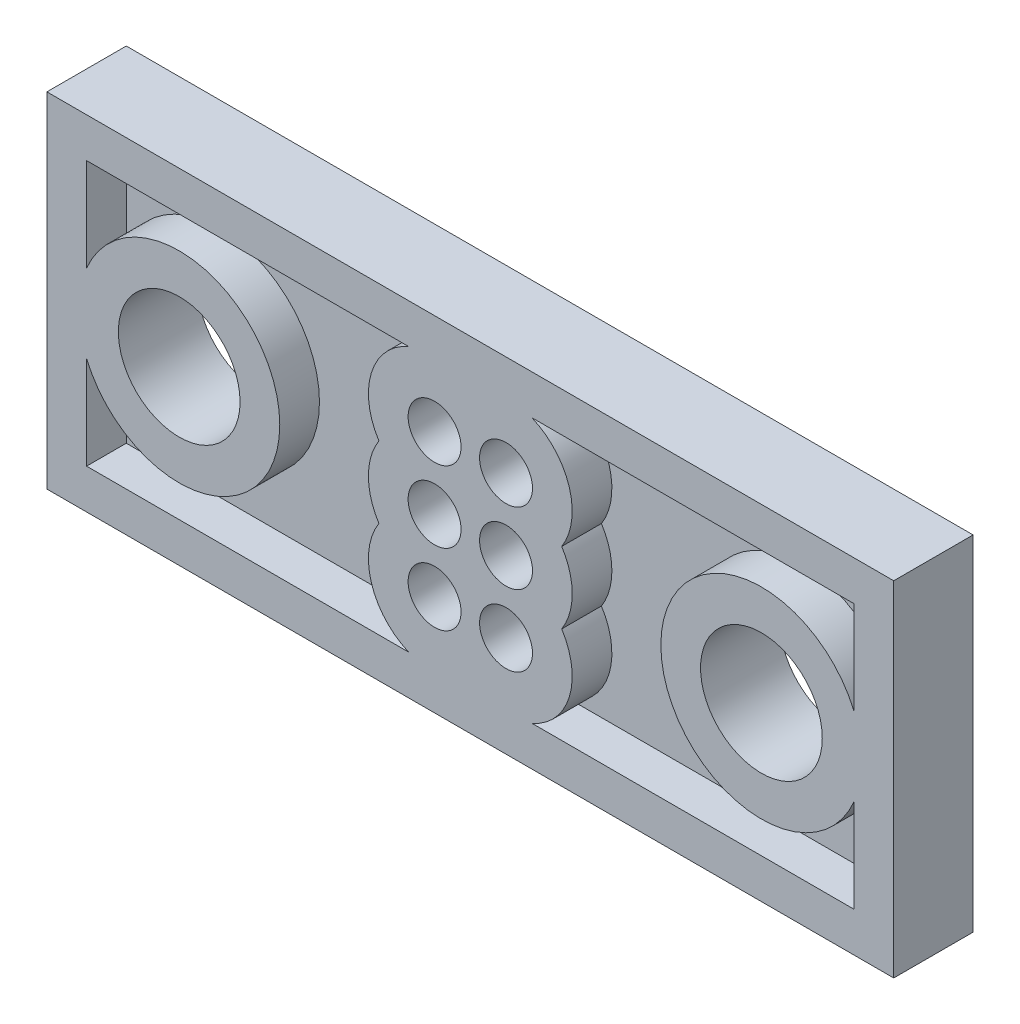
ISO-10303-21;
HEADER;
FILE_DESCRIPTION(('STEP AP214'),'2;1');
FILE_NAME('part.step','',(''),(''),'','','');
FILE_SCHEMA(('AUTOMOTIVE_DESIGN { 1 0 10303 214 1 1 1 1 }'));
ENDSEC;
DATA;
#1=APPLICATION_CONTEXT('core data for automotive mechanical design processes');
#2=APPLICATION_PROTOCOL_DEFINITION('international standard','automotive_design',2000,#1);
#3=PRODUCT_CONTEXT('',#1,'mechanical');
#4=PRODUCT('Part','Part','',(#3));
#5=PRODUCT_RELATED_PRODUCT_CATEGORY('part','',(#4));
#6=PRODUCT_DEFINITION_FORMATION('','',#4);
#7=PRODUCT_DEFINITION_CONTEXT('part definition',#1,'design');
#8=PRODUCT_DEFINITION('design','',#6,#7);
#9=PRODUCT_DEFINITION_SHAPE('','',#8);
#10=(LENGTH_UNIT() NAMED_UNIT(*) SI_UNIT(.MILLI.,.METRE.));
#11=(NAMED_UNIT(*) PLANE_ANGLE_UNIT() SI_UNIT($,.RADIAN.));
#12=(NAMED_UNIT(*) SI_UNIT($,.STERADIAN.) SOLID_ANGLE_UNIT());
#13=UNCERTAINTY_MEASURE_WITH_UNIT(LENGTH_MEASURE(1.E-05),#10,'distance_accuracy_value','');
#14=(GEOMETRIC_REPRESENTATION_CONTEXT(3) GLOBAL_UNCERTAINTY_ASSIGNED_CONTEXT((#13)) GLOBAL_UNIT_ASSIGNED_CONTEXT((#10,
#11,#12)) REPRESENTATION_CONTEXT('',''));
#15=CARTESIAN_POINT('',(0.,0.,0.));
#16=DIRECTION('',(0.,0.,1.));
#17=DIRECTION('',(1.,0.,0.));
#18=AXIS2_PLACEMENT_3D('',#15,#16,#17);
#19=CARTESIAN_POINT('',(0.,0.,3.));
#20=DIRECTION('',(0.,0.,-1.));
#21=DIRECTION('',(-1.,0.,0.));
#22=AXIS2_PLACEMENT_3D('',#19,#20,#21);
#23=PLANE('',#22);
#24=DIRECTION('',(0.,-1.,0.));
#25=VECTOR('',#24,1.);
#26=CARTESIAN_POINT('',(0.,0.,3.));
#27=LINE('',#26,#25);
#28=CARTESIAN_POINT('',(0.,13.,3.));
#29=VERTEX_POINT('',#28);
#30=CARTESIAN_POINT('',(0.,0.,3.));
#31=VERTEX_POINT('',#30);
#32=EDGE_CURVE('E350',#29,#31,#27,.T.);
#33=ORIENTED_EDGE('',*,*,#32,.T.);
#34=DIRECTION('',(1.,0.,0.));
#35=VECTOR('',#34,1.);
#36=CARTESIAN_POINT('',(0.,0.,3.));
#37=LINE('',#36,#35);
#38=CARTESIAN_POINT('',(32.,0.,3.));
#39=VERTEX_POINT('',#38);
#40=EDGE_CURVE('E353',#31,#39,#37,.T.);
#41=ORIENTED_EDGE('',*,*,#40,.T.);
#42=DIRECTION('',(0.,1.,0.));
#43=VECTOR('',#42,1.);
#44=CARTESIAN_POINT('',(32.,0.,3.));
#45=LINE('',#44,#43);
#46=CARTESIAN_POINT('',(32.,13.,3.));
#47=VERTEX_POINT('',#46);
#48=EDGE_CURVE('E356',#39,#47,#45,.T.);
#49=ORIENTED_EDGE('',*,*,#48,.T.);
#50=DIRECTION('',(-1.,0.,0.));
#51=VECTOR('',#50,1.);
#52=CARTESIAN_POINT('',(0.,13.,3.));
#53=LINE('',#52,#51);
#54=EDGE_CURVE('E358',#47,#29,#53,.T.);
#55=ORIENTED_EDGE('',*,*,#54,.T.);
#56=EDGE_LOOP('',(#33,#41,#49,#55));
#57=FACE_BOUND('',#56,.T.);
#58=CARTESIAN_POINT('',(5.,6.5,3.));
#59=DIRECTION('',(0.,0.,1.));
#60=DIRECTION('',(1.,0.,0.));
#61=AXIS2_PLACEMENT_3D('',#58,#59,#60);
#62=CIRCLE('',#61,2.3);
#63=CARTESIAN_POINT('',(7.3,6.5,3.));
#64=VERTEX_POINT('',#63);
#65=EDGE_CURVE('E344',#64,#64,#62,.T.);
#66=ORIENTED_EDGE('',*,*,#65,.F.);
#67=EDGE_LOOP('',(#66));
#68=FACE_BOUND('',#67,.T.);
#69=CARTESIAN_POINT('',(27.,6.5,3.));
#70=DIRECTION('',(0.,0.,1.));
#71=DIRECTION('',(1.,0.,0.));
#72=AXIS2_PLACEMENT_3D('',#69,#70,#71);
#73=CIRCLE('',#72,2.3);
#74=CARTESIAN_POINT('',(29.3,6.5,3.));
#75=VERTEX_POINT('',#74);
#76=EDGE_CURVE('E338',#75,#75,#73,.T.);
#77=ORIENTED_EDGE('',*,*,#76,.F.);
#78=EDGE_LOOP('',(#77));
#79=FACE_BOUND('',#78,.T.);
#80=CARTESIAN_POINT('',(14.65,9.2,3.));
#81=DIRECTION('',(0.,0.,1.));
#82=DIRECTION('',(1.,0.,0.));
#83=AXIS2_PLACEMENT_3D('',#80,#81,#82);
#84=CIRCLE('',#83,1.);
#85=CARTESIAN_POINT('',(15.65,9.2,3.));
#86=VERTEX_POINT('',#85);
#87=EDGE_CURVE('E332',#86,#86,#84,.T.);
#88=ORIENTED_EDGE('',*,*,#87,.F.);
#89=EDGE_LOOP('',(#88));
#90=FACE_BOUND('',#89,.T.);
#91=CARTESIAN_POINT('',(17.35,9.2,3.));
#92=DIRECTION('',(0.,0.,1.));
#93=DIRECTION('',(1.,0.,0.));
#94=AXIS2_PLACEMENT_3D('',#91,#92,#93);
#95=CIRCLE('',#94,1.);
#96=CARTESIAN_POINT('',(18.35,9.2,3.));
#97=VERTEX_POINT('',#96);
#98=EDGE_CURVE('E326',#97,#97,#95,.T.);
#99=ORIENTED_EDGE('',*,*,#98,.F.);
#100=EDGE_LOOP('',(#99));
#101=FACE_BOUND('',#100,.T.);
#102=CARTESIAN_POINT('',(17.35,6.5,3.));
#103=DIRECTION('',(0.,0.,1.));
#104=DIRECTION('',(1.,0.,0.));
#105=AXIS2_PLACEMENT_3D('',#102,#103,#104);
#106=CIRCLE('',#105,1.);
#107=CARTESIAN_POINT('',(18.35,6.5,3.));
#108=VERTEX_POINT('',#107);
#109=EDGE_CURVE('E320',#108,#108,#106,.T.);
#110=ORIENTED_EDGE('',*,*,#109,.F.);
#111=EDGE_LOOP('',(#110));
#112=FACE_BOUND('',#111,.T.);
#113=CARTESIAN_POINT('',(17.35,3.8,3.));
#114=DIRECTION('',(0.,0.,1.));
#115=DIRECTION('',(1.,0.,0.));
#116=AXIS2_PLACEMENT_3D('',#113,#114,#115);
#117=CIRCLE('',#116,1.);
#118=CARTESIAN_POINT('',(18.35,3.8,3.));
#119=VERTEX_POINT('',#118);
#120=EDGE_CURVE('E314',#119,#119,#117,.T.);
#121=ORIENTED_EDGE('',*,*,#120,.F.);
#122=EDGE_LOOP('',(#121));
#123=FACE_BOUND('',#122,.T.);
#124=CARTESIAN_POINT('',(14.65,3.8,3.));
#125=DIRECTION('',(0.,0.,1.));
#126=DIRECTION('',(1.,0.,0.));
#127=AXIS2_PLACEMENT_3D('',#124,#125,#126);
#128=CIRCLE('',#127,1.);
#129=CARTESIAN_POINT('',(15.65,3.8,3.));
#130=VERTEX_POINT('',#129);
#131=EDGE_CURVE('E308',#130,#130,#128,.T.);
#132=ORIENTED_EDGE('',*,*,#131,.F.);
#133=EDGE_LOOP('',(#132));
#134=FACE_BOUND('',#133,.T.);
#135=CARTESIAN_POINT('',(14.65,6.5,3.));
#136=DIRECTION('',(0.,0.,1.));
#137=DIRECTION('',(1.,0.,0.));
#138=AXIS2_PLACEMENT_3D('',#135,#136,#137);
#139=CIRCLE('',#138,1.);
#140=CARTESIAN_POINT('',(15.65,6.5,3.));
#141=VERTEX_POINT('',#140);
#142=EDGE_CURVE('E302',#141,#141,#139,.T.);
#143=ORIENTED_EDGE('',*,*,#142,.F.);
#144=EDGE_LOOP('',(#143));
#145=FACE_BOUND('',#144,.T.);
#146=CARTESIAN_POINT('',(17.35,6.5,3.));
#147=DIRECTION('',(0.,0.,-1.));
#148=DIRECTION('',(-1.,0.,0.));
#149=AXIS2_PLACEMENT_3D('',#146,#147,#148);
#150=CIRCLE('',#149,2.5);
#151=CARTESIAN_POINT('',(19.4541625412501,7.85,3.));
#152=VERTEX_POINT('',#151);
#153=CARTESIAN_POINT('',(19.4541625412501,5.15000000000001,3.));
#154=VERTEX_POINT('',#153);
#155=EDGE_CURVE('E268',#152,#154,#150,.T.);
#156=ORIENTED_EDGE('',*,*,#155,.F.);
#157=CARTESIAN_POINT('',(17.35,9.2,3.));
#158=DIRECTION('',(0.,0.,-1.));
#159=DIRECTION('',(-1.,0.,0.));
#160=AXIS2_PLACEMENT_3D('',#157,#158,#159);
#161=CIRCLE('',#160,2.5);
#162=CARTESIAN_POINT('',(18.3297958971133,11.5,3.));
#163=VERTEX_POINT('',#162);
#164=EDGE_CURVE('E55',#163,#152,#161,.T.);
#165=ORIENTED_EDGE('',*,*,#164,.F.);
#166=DIRECTION('',(-1.,0.,0.));
#167=VECTOR('',#166,1.);
#168=CARTESIAN_POINT('',(30.5,11.5,3.));
#169=LINE('',#168,#167);
#170=CARTESIAN_POINT('',(30.5,11.5,3.));
#171=VERTEX_POINT('',#170);
#172=EDGE_CURVE('E245',#171,#163,#169,.T.);
#173=ORIENTED_EDGE('',*,*,#172,.F.);
#174=DIRECTION('',(0.,1.,0.));
#175=VECTOR('',#174,1.);
#176=CARTESIAN_POINT('',(30.5,11.5,3.));
#177=LINE('',#176,#175);
#178=CARTESIAN_POINT('',(30.5,7.97986485869488,3.));
#179=VERTEX_POINT('',#178);
#180=EDGE_CURVE('E283',#179,#171,#177,.T.);
#181=ORIENTED_EDGE('',*,*,#180,.F.);
#182=CARTESIAN_POINT('',(27.,6.5,3.));
#183=DIRECTION('',(0.,0.,-1.));
#184=DIRECTION('',(-1.,0.,0.));
#185=AXIS2_PLACEMENT_3D('',#182,#183,#184);
#186=CIRCLE('',#185,3.8);
#187=CARTESIAN_POINT('',(30.5,5.02013514130513,3.));
#188=VERTEX_POINT('',#187);
#189=EDGE_CURVE('E280',#188,#179,#186,.T.);
#190=ORIENTED_EDGE('',*,*,#189,.F.);
#191=DIRECTION('',(0.,1.,0.));
#192=VECTOR('',#191,1.);
#193=CARTESIAN_POINT('',(30.5,1.50000000000001,3.));
#194=LINE('',#193,#192);
#195=CARTESIAN_POINT('',(30.5,1.50000000000001,3.));
#196=VERTEX_POINT('',#195);
#197=EDGE_CURVE('E277',#196,#188,#194,.T.);
#198=ORIENTED_EDGE('',*,*,#197,.F.);
#199=DIRECTION('',(1.,0.,0.));
#200=VECTOR('',#199,1.);
#201=CARTESIAN_POINT('',(30.5,1.50000000000001,3.));
#202=LINE('',#201,#200);
#203=CARTESIAN_POINT('',(18.3297958971133,1.50000000000001,3.));
#204=VERTEX_POINT('',#203);
#205=EDGE_CURVE('E274',#204,#196,#202,.T.);
#206=ORIENTED_EDGE('',*,*,#205,.F.);
#207=CARTESIAN_POINT('',(17.35,3.80000000000001,3.));
#208=DIRECTION('',(0.,0.,-1.));
#209=DIRECTION('',(1.,0.,0.));
#210=AXIS2_PLACEMENT_3D('',#207,#208,#209);
#211=CIRCLE('',#210,2.5);
#212=EDGE_CURVE('E271',#154,#204,#211,.T.);
#213=ORIENTED_EDGE('',*,*,#212,.F.);
#214=EDGE_LOOP('',(#156,#165,#173,#181,#190,#198,#206,#213));
#215=FACE_BOUND('',#214,.T.);
#216=CARTESIAN_POINT('',(14.65,3.8,3.));
#217=DIRECTION('',(0.,0.,-1.));
#218=DIRECTION('',(-1.,0.,0.));
#219=AXIS2_PLACEMENT_3D('',#216,#217,#218);
#220=CIRCLE('',#219,2.5);
#221=CARTESIAN_POINT('',(13.6702041028867,1.50000000000001,3.));
#222=VERTEX_POINT('',#221);
#223=CARTESIAN_POINT('',(12.5458374587499,5.15,3.));
#224=VERTEX_POINT('',#223);
#225=EDGE_CURVE('E210',#222,#224,#220,.T.);
#226=ORIENTED_EDGE('',*,*,#225,.F.);
#227=DIRECTION('',(1.,0.,0.));
#228=VECTOR('',#227,1.);
#229=CARTESIAN_POINT('',(1.5,1.50000000000001,3.));
#230=LINE('',#229,#228);
#231=CARTESIAN_POINT('',(1.5,1.50000000000001,3.));
#232=VERTEX_POINT('',#231);
#233=EDGE_CURVE('E47',#232,#222,#230,.T.);
#234=ORIENTED_EDGE('',*,*,#233,.F.);
#235=DIRECTION('',(0.,-1.,0.));
#236=VECTOR('',#235,1.);
#237=CARTESIAN_POINT('',(1.5,1.50000000000001,3.));
#238=LINE('',#237,#236);
#239=CARTESIAN_POINT('',(1.5,5.02013514130513,3.));
#240=VERTEX_POINT('',#239);
#241=EDGE_CURVE('E190',#240,#232,#238,.T.);
#242=ORIENTED_EDGE('',*,*,#241,.F.);
#243=CARTESIAN_POINT('',(5.,6.5,3.));
#244=DIRECTION('',(0.,0.,-1.));
#245=DIRECTION('',(1.,0.,0.));
#246=AXIS2_PLACEMENT_3D('',#243,#244,#245);
#247=CIRCLE('',#246,3.8);
#248=CARTESIAN_POINT('',(1.5,7.97986485869488,3.));
#249=VERTEX_POINT('',#248);
#250=EDGE_CURVE('E193',#249,#240,#247,.T.);
#251=ORIENTED_EDGE('',*,*,#250,.F.);
#252=DIRECTION('',(0.,-1.,0.));
#253=VECTOR('',#252,1.);
#254=CARTESIAN_POINT('',(1.5,11.5,3.));
#255=LINE('',#254,#253);
#256=CARTESIAN_POINT('',(1.5,11.5,3.));
#257=VERTEX_POINT('',#256);
#258=EDGE_CURVE('E222',#257,#249,#255,.T.);
#259=ORIENTED_EDGE('',*,*,#258,.F.);
#260=DIRECTION('',(-1.,0.,0.));
#261=VECTOR('',#260,1.);
#262=CARTESIAN_POINT('',(1.5,11.5,3.));
#263=LINE('',#262,#261);
#264=CARTESIAN_POINT('',(13.6702041028867,11.5,3.));
#265=VERTEX_POINT('',#264);
#266=EDGE_CURVE('E219',#265,#257,#263,.T.);
#267=ORIENTED_EDGE('',*,*,#266,.F.);
#268=CARTESIAN_POINT('',(14.65,9.2,3.));
#269=DIRECTION('',(0.,0.,-1.));
#270=DIRECTION('',(1.,0.,0.));
#271=AXIS2_PLACEMENT_3D('',#268,#269,#270);
#272=CIRCLE('',#271,2.5);
#273=CARTESIAN_POINT('',(12.5458374587499,7.85,3.));
#274=VERTEX_POINT('',#273);
#275=EDGE_CURVE('E216',#274,#265,#272,.T.);
#276=ORIENTED_EDGE('',*,*,#275,.F.);
#277=CARTESIAN_POINT('',(14.65,6.5,3.));
#278=DIRECTION('',(0.,0.,-1.));
#279=DIRECTION('',(1.,0.,0.));
#280=AXIS2_PLACEMENT_3D('',#277,#278,#279);
#281=CIRCLE('',#280,2.5);
#282=EDGE_CURVE('E213',#224,#274,#281,.T.);
#283=ORIENTED_EDGE('',*,*,#282,.F.);
#284=EDGE_LOOP('',(#226,#234,#242,#251,#259,#267,#276,#283));
#285=FACE_BOUND('',#284,.T.);
#286=ADVANCED_FACE('F32',(#57,#68,#79,#90,#101,#112,#123,#134,#145,#215,#285),#23,.F.);
#287=CARTESIAN_POINT('',(0.,0.,0.));
#288=DIRECTION('',(0.,0.,-1.));
#289=DIRECTION('',(-1.,0.,0.));
#290=AXIS2_PLACEMENT_3D('',#287,#288,#289);
#291=PLANE('',#290);
#292=CARTESIAN_POINT('',(14.65,3.8,0.));
#293=DIRECTION('',(0.,0.,1.));
#294=DIRECTION('',(1.,0.,0.));
#295=AXIS2_PLACEMENT_3D('',#292,#293,#294);
#296=CIRCLE('',#295,1.);
#297=CARTESIAN_POINT('',(15.65,3.8,0.));
#298=VERTEX_POINT('',#297);
#299=EDGE_CURVE('E305',#298,#298,#296,.T.);
#300=ORIENTED_EDGE('',*,*,#299,.T.);
#301=EDGE_LOOP('',(#300));
#302=FACE_BOUND('',#301,.T.);
#303=CARTESIAN_POINT('',(17.35,6.5,0.));
#304=DIRECTION('',(0.,0.,1.));
#305=DIRECTION('',(1.,0.,0.));
#306=AXIS2_PLACEMENT_3D('',#303,#304,#305);
#307=CIRCLE('',#306,1.);
#308=CARTESIAN_POINT('',(18.35,6.5,0.));
#309=VERTEX_POINT('',#308);
#310=EDGE_CURVE('E317',#309,#309,#307,.T.);
#311=ORIENTED_EDGE('',*,*,#310,.T.);
#312=EDGE_LOOP('',(#311));
#313=FACE_BOUND('',#312,.T.);
#314=CARTESIAN_POINT('',(14.65,9.2,0.));
#315=DIRECTION('',(0.,0.,1.));
#316=DIRECTION('',(1.,0.,0.));
#317=AXIS2_PLACEMENT_3D('',#314,#315,#316);
#318=CIRCLE('',#317,1.);
#319=CARTESIAN_POINT('',(15.65,9.2,0.));
#320=VERTEX_POINT('',#319);
#321=EDGE_CURVE('E329',#320,#320,#318,.T.);
#322=ORIENTED_EDGE('',*,*,#321,.T.);
#323=EDGE_LOOP('',(#322));
#324=FACE_BOUND('',#323,.T.);
#325=CARTESIAN_POINT('',(5.,6.5,0.));
#326=DIRECTION('',(0.,0.,1.));
#327=DIRECTION('',(1.,0.,0.));
#328=AXIS2_PLACEMENT_3D('',#325,#326,#327);
#329=CIRCLE('',#328,2.3);
#330=CARTESIAN_POINT('',(7.3,6.5,0.));
#331=VERTEX_POINT('',#330);
#332=EDGE_CURVE('E341',#331,#331,#329,.T.);
#333=ORIENTED_EDGE('',*,*,#332,.T.);
#334=EDGE_LOOP('',(#333));
#335=FACE_BOUND('',#334,.T.);
#336=DIRECTION('',(0.,-1.,0.));
#337=VECTOR('',#336,1.);
#338=CARTESIAN_POINT('',(0.,0.,0.));
#339=LINE('',#338,#337);
#340=CARTESIAN_POINT('',(0.,13.,0.));
#341=VERTEX_POINT('',#340);
#342=CARTESIAN_POINT('',(0.,0.,0.));
#343=VERTEX_POINT('',#342);
#344=EDGE_CURVE('E347',#341,#343,#339,.T.);
#345=ORIENTED_EDGE('',*,*,#344,.F.);
#346=DIRECTION('',(-1.,0.,0.));
#347=VECTOR('',#346,1.);
#348=CARTESIAN_POINT('',(0.,13.,0.));
#349=LINE('',#348,#347);
#350=CARTESIAN_POINT('',(32.,13.,0.));
#351=VERTEX_POINT('',#350);
#352=EDGE_CURVE('E354',#351,#341,#349,.T.);
#353=ORIENTED_EDGE('',*,*,#352,.F.);
#354=DIRECTION('',(0.,1.,0.));
#355=VECTOR('',#354,1.);
#356=CARTESIAN_POINT('',(32.,0.,0.));
#357=LINE('',#356,#355);
#358=CARTESIAN_POINT('',(32.,0.,0.));
#359=VERTEX_POINT('',#358);
#360=EDGE_CURVE('E365',#359,#351,#357,.T.);
#361=ORIENTED_EDGE('',*,*,#360,.F.);
#362=DIRECTION('',(1.,0.,0.));
#363=VECTOR('',#362,1.);
#364=CARTESIAN_POINT('',(0.,0.,0.));
#365=LINE('',#364,#363);
#366=EDGE_CURVE('E363',#343,#359,#365,.T.);
#367=ORIENTED_EDGE('',*,*,#366,.F.);
#368=EDGE_LOOP('',(#345,#353,#361,#367));
#369=FACE_BOUND('',#368,.T.);
#370=CARTESIAN_POINT('',(27.,6.5,0.));
#371=DIRECTION('',(0.,0.,1.));
#372=DIRECTION('',(1.,0.,0.));
#373=AXIS2_PLACEMENT_3D('',#370,#371,#372);
#374=CIRCLE('',#373,2.3);
#375=CARTESIAN_POINT('',(29.3,6.5,0.));
#376=VERTEX_POINT('',#375);
#377=EDGE_CURVE('E335',#376,#376,#374,.T.);
#378=ORIENTED_EDGE('',*,*,#377,.T.);
#379=EDGE_LOOP('',(#378));
#380=FACE_BOUND('',#379,.T.);
#381=CARTESIAN_POINT('',(17.35,9.2,0.));
#382=DIRECTION('',(0.,0.,1.));
#383=DIRECTION('',(1.,0.,0.));
#384=AXIS2_PLACEMENT_3D('',#381,#382,#383);
#385=CIRCLE('',#384,1.);
#386=CARTESIAN_POINT('',(18.35,9.2,0.));
#387=VERTEX_POINT('',#386);
#388=EDGE_CURVE('E323',#387,#387,#385,.T.);
#389=ORIENTED_EDGE('',*,*,#388,.T.);
#390=EDGE_LOOP('',(#389));
#391=FACE_BOUND('',#390,.T.);
#392=CARTESIAN_POINT('',(17.35,3.8,0.));
#393=DIRECTION('',(0.,0.,1.));
#394=DIRECTION('',(1.,0.,0.));
#395=AXIS2_PLACEMENT_3D('',#392,#393,#394);
#396=CIRCLE('',#395,1.);
#397=CARTESIAN_POINT('',(18.35,3.8,0.));
#398=VERTEX_POINT('',#397);
#399=EDGE_CURVE('E311',#398,#398,#396,.T.);
#400=ORIENTED_EDGE('',*,*,#399,.T.);
#401=EDGE_LOOP('',(#400));
#402=FACE_BOUND('',#401,.T.);
#403=CARTESIAN_POINT('',(14.65,6.5,0.));
#404=DIRECTION('',(0.,0.,1.));
#405=DIRECTION('',(1.,0.,0.));
#406=AXIS2_PLACEMENT_3D('',#403,#404,#405);
#407=CIRCLE('',#406,1.);
#408=CARTESIAN_POINT('',(15.65,6.5,0.));
#409=VERTEX_POINT('',#408);
#410=EDGE_CURVE('E229',#409,#409,#407,.T.);
#411=ORIENTED_EDGE('',*,*,#410,.T.);
#412=EDGE_LOOP('',(#411));
#413=FACE_BOUND('',#412,.T.);
#414=ADVANCED_FACE('F383',(#302,#313,#324,#335,#369,#380,#391,#402,#413),#291,.T.);
#415=CARTESIAN_POINT('',(0.,0.,3.));
#416=DIRECTION('',(1.,0.,0.));
#417=DIRECTION('',(0.,0.,-1.));
#418=AXIS2_PLACEMENT_3D('',#415,#416,#417);
#419=PLANE('',#418);
#420=ORIENTED_EDGE('',*,*,#344,.T.);
#421=DIRECTION('',(0.,0.,-1.));
#422=VECTOR('',#421,1.);
#423=CARTESIAN_POINT('',(0.,0.,3.));
#424=LINE('',#423,#422);
#425=EDGE_CURVE('E11',#31,#343,#424,.T.);
#426=ORIENTED_EDGE('',*,*,#425,.F.);
#427=ORIENTED_EDGE('',*,*,#32,.F.);
#428=DIRECTION('',(0.,0.,-1.));
#429=VECTOR('',#428,1.);
#430=CARTESIAN_POINT('',(0.,13.,3.));
#431=LINE('',#430,#429);
#432=EDGE_CURVE('E360',#29,#341,#431,.T.);
#433=ORIENTED_EDGE('',*,*,#432,.T.);
#434=EDGE_LOOP('',(#420,#426,#427,#433));
#435=FACE_BOUND('',#434,.T.);
#436=ADVANCED_FACE('F34',(#435),#419,.F.);
#437=CARTESIAN_POINT('',(0.,0.,3.));
#438=DIRECTION('',(0.,1.,0.));
#439=DIRECTION('',(0.,0.,1.));
#440=AXIS2_PLACEMENT_3D('',#437,#438,#439);
#441=PLANE('',#440);
#442=ORIENTED_EDGE('',*,*,#366,.T.);
#443=DIRECTION('',(0.,0.,-1.));
#444=VECTOR('',#443,1.);
#445=CARTESIAN_POINT('',(32.,0.,3.));
#446=LINE('',#445,#444);
#447=EDGE_CURVE('E40',#39,#359,#446,.T.);
#448=ORIENTED_EDGE('',*,*,#447,.F.);
#449=ORIENTED_EDGE('',*,*,#40,.F.);
#450=ORIENTED_EDGE('',*,*,#425,.T.);
#451=EDGE_LOOP('',(#442,#448,#449,#450));
#452=FACE_BOUND('',#451,.T.);
#453=ADVANCED_FACE('F394',(#452),#441,.F.);
#454=CARTESIAN_POINT('',(32.,0.,3.));
#455=DIRECTION('',(-1.,0.,0.));
#456=DIRECTION('',(0.,0.,1.));
#457=AXIS2_PLACEMENT_3D('',#454,#455,#456);
#458=PLANE('',#457);
#459=ORIENTED_EDGE('',*,*,#360,.T.);
#460=DIRECTION('',(0.,0.,-1.));
#461=VECTOR('',#460,1.);
#462=CARTESIAN_POINT('',(32.,13.,3.));
#463=LINE('',#462,#461);
#464=EDGE_CURVE('E370',#47,#351,#463,.T.);
#465=ORIENTED_EDGE('',*,*,#464,.F.);
#466=ORIENTED_EDGE('',*,*,#48,.F.);
#467=ORIENTED_EDGE('',*,*,#447,.T.);
#468=EDGE_LOOP('',(#459,#465,#466,#467));
#469=FACE_BOUND('',#468,.T.);
#470=ADVANCED_FACE('F377',(#469),#458,.F.);
#471=CARTESIAN_POINT('',(0.,13.,3.));
#472=DIRECTION('',(0.,-1.,0.));
#473=DIRECTION('',(0.,0.,-1.));
#474=AXIS2_PLACEMENT_3D('',#471,#472,#473);
#475=PLANE('',#474);
#476=ORIENTED_EDGE('',*,*,#352,.T.);
#477=ORIENTED_EDGE('',*,*,#432,.F.);
#478=ORIENTED_EDGE('',*,*,#54,.F.);
#479=ORIENTED_EDGE('',*,*,#464,.T.);
#480=EDGE_LOOP('',(#476,#477,#478,#479));
#481=FACE_BOUND('',#480,.T.);
#482=ADVANCED_FACE('F387',(#481),#475,.F.);
#483=CARTESIAN_POINT('',(5.,6.5,3.));
#484=DIRECTION('',(0.,0.,-1.));
#485=DIRECTION('',(-1.,0.,0.));
#486=AXIS2_PLACEMENT_3D('',#483,#484,#485);
#487=CYLINDRICAL_SURFACE('',#486,2.3);
#488=ORIENTED_EDGE('',*,*,#65,.T.);
#489=EDGE_LOOP('',(#488));
#490=FACE_BOUND('',#489,.T.);
#491=ORIENTED_EDGE('',*,*,#332,.F.);
#492=EDGE_LOOP('',(#491));
#493=FACE_BOUND('',#492,.T.);
#494=ADVANCED_FACE('F409',(#490,#493),#487,.F.);
#495=CARTESIAN_POINT('',(27.,6.5,3.));
#496=DIRECTION('',(0.,0.,-1.));
#497=DIRECTION('',(-1.,0.,0.));
#498=AXIS2_PLACEMENT_3D('',#495,#496,#497);
#499=CYLINDRICAL_SURFACE('',#498,2.3);
#500=ORIENTED_EDGE('',*,*,#76,.T.);
#501=EDGE_LOOP('',(#500));
#502=FACE_BOUND('',#501,.T.);
#503=ORIENTED_EDGE('',*,*,#377,.F.);
#504=EDGE_LOOP('',(#503));
#505=FACE_BOUND('',#504,.T.);
#506=ADVANCED_FACE('F416',(#502,#505),#499,.F.);
#507=CARTESIAN_POINT('',(14.65,9.2,3.));
#508=DIRECTION('',(0.,0.,-1.));
#509=DIRECTION('',(-1.,0.,0.));
#510=AXIS2_PLACEMENT_3D('',#507,#508,#509);
#511=CYLINDRICAL_SURFACE('',#510,1.);
#512=ORIENTED_EDGE('',*,*,#87,.T.);
#513=EDGE_LOOP('',(#512));
#514=FACE_BOUND('',#513,.T.);
#515=ORIENTED_EDGE('',*,*,#321,.F.);
#516=EDGE_LOOP('',(#515));
#517=FACE_BOUND('',#516,.T.);
#518=ADVANCED_FACE('F421',(#514,#517),#511,.F.);
#519=CARTESIAN_POINT('',(17.35,9.2,3.));
#520=DIRECTION('',(0.,0.,-1.));
#521=DIRECTION('',(-1.,0.,0.));
#522=AXIS2_PLACEMENT_3D('',#519,#520,#521);
#523=CYLINDRICAL_SURFACE('',#522,1.);
#524=ORIENTED_EDGE('',*,*,#98,.T.);
#525=EDGE_LOOP('',(#524));
#526=FACE_BOUND('',#525,.T.);
#527=ORIENTED_EDGE('',*,*,#388,.F.);
#528=EDGE_LOOP('',(#527));
#529=FACE_BOUND('',#528,.T.);
#530=ADVANCED_FACE('F537',(#526,#529),#523,.F.);
#531=CARTESIAN_POINT('',(17.35,6.5,3.));
#532=DIRECTION('',(0.,0.,-1.));
#533=DIRECTION('',(-1.,0.,0.));
#534=AXIS2_PLACEMENT_3D('',#531,#532,#533);
#535=CYLINDRICAL_SURFACE('',#534,1.);
#536=ORIENTED_EDGE('',*,*,#109,.T.);
#537=EDGE_LOOP('',(#536));
#538=FACE_BOUND('',#537,.T.);
#539=ORIENTED_EDGE('',*,*,#310,.F.);
#540=EDGE_LOOP('',(#539));
#541=FACE_BOUND('',#540,.T.);
#542=ADVANCED_FACE('F533',(#538,#541),#535,.F.);
#543=CARTESIAN_POINT('',(17.35,3.8,3.));
#544=DIRECTION('',(0.,0.,-1.));
#545=DIRECTION('',(-1.,0.,0.));
#546=AXIS2_PLACEMENT_3D('',#543,#544,#545);
#547=CYLINDRICAL_SURFACE('',#546,1.);
#548=ORIENTED_EDGE('',*,*,#120,.T.);
#549=EDGE_LOOP('',(#548));
#550=FACE_BOUND('',#549,.T.);
#551=ORIENTED_EDGE('',*,*,#399,.F.);
#552=EDGE_LOOP('',(#551));
#553=FACE_BOUND('',#552,.T.);
#554=ADVANCED_FACE('F529',(#550,#553),#547,.F.);
#555=CARTESIAN_POINT('',(14.65,3.8,3.));
#556=DIRECTION('',(0.,0.,-1.));
#557=DIRECTION('',(-1.,0.,0.));
#558=AXIS2_PLACEMENT_3D('',#555,#556,#557);
#559=CYLINDRICAL_SURFACE('',#558,1.);
#560=ORIENTED_EDGE('',*,*,#131,.T.);
#561=EDGE_LOOP('',(#560));
#562=FACE_BOUND('',#561,.T.);
#563=ORIENTED_EDGE('',*,*,#299,.F.);
#564=EDGE_LOOP('',(#563));
#565=FACE_BOUND('',#564,.T.);
#566=ADVANCED_FACE('F525',(#562,#565),#559,.F.);
#567=CARTESIAN_POINT('',(14.65,6.5,3.));
#568=DIRECTION('',(0.,0.,-1.));
#569=DIRECTION('',(-1.,0.,0.));
#570=AXIS2_PLACEMENT_3D('',#567,#568,#569);
#571=CYLINDRICAL_SURFACE('',#570,1.);
#572=ORIENTED_EDGE('',*,*,#142,.T.);
#573=EDGE_LOOP('',(#572));
#574=FACE_BOUND('',#573,.T.);
#575=ORIENTED_EDGE('',*,*,#410,.F.);
#576=EDGE_LOOP('',(#575));
#577=FACE_BOUND('',#576,.T.);
#578=ADVANCED_FACE('F522',(#574,#577),#571,.F.);
#579=CARTESIAN_POINT('',(17.35,9.2,1.5));
#580=DIRECTION('',(0.,0.,1.));
#581=DIRECTION('',(1.,0.,0.));
#582=AXIS2_PLACEMENT_3D('',#579,#580,#581);
#583=CYLINDRICAL_SURFACE('',#582,2.5);
#584=ORIENTED_EDGE('',*,*,#164,.T.);
#585=DIRECTION('',(0.,0.,1.));
#586=VECTOR('',#585,1.);
#587=CARTESIAN_POINT('',(19.4541625412501,7.85,1.5));
#588=LINE('',#587,#586);
#589=CARTESIAN_POINT('',(19.4541625412501,7.85,1.5));
#590=VERTEX_POINT('',#589);
#591=EDGE_CURVE('E266',#590,#152,#588,.T.);
#592=ORIENTED_EDGE('',*,*,#591,.F.);
#593=CARTESIAN_POINT('',(17.35,9.2,1.5));
#594=DIRECTION('',(0.,0.,-1.));
#595=DIRECTION('',(-1.,0.,0.));
#596=AXIS2_PLACEMENT_3D('',#593,#594,#595);
#597=CIRCLE('',#596,2.5);
#598=CARTESIAN_POINT('',(18.3297958971133,11.5,1.5));
#599=VERTEX_POINT('',#598);
#600=EDGE_CURVE('E241',#599,#590,#597,.T.);
#601=ORIENTED_EDGE('',*,*,#600,.F.);
#602=DIRECTION('',(0.,0.,1.));
#603=VECTOR('',#602,1.);
#604=CARTESIAN_POINT('',(18.3297958971133,11.5,1.5));
#605=LINE('',#604,#603);
#606=EDGE_CURVE('E211',#599,#163,#605,.T.);
#607=ORIENTED_EDGE('',*,*,#606,.T.);
#608=EDGE_LOOP('',(#584,#592,#601,#607));
#609=FACE_BOUND('',#608,.T.);
#610=ADVANCED_FACE('F496',(#609),#583,.T.);
#611=CARTESIAN_POINT('',(30.5,11.5,1.5));
#612=DIRECTION('',(0.,1.,0.));
#613=DIRECTION('',(0.,0.,1.));
#614=AXIS2_PLACEMENT_3D('',#611,#612,#613);
#615=PLANE('',#614);
#616=ORIENTED_EDGE('',*,*,#172,.T.);
#617=ORIENTED_EDGE('',*,*,#606,.F.);
#618=DIRECTION('',(-1.,0.,0.));
#619=VECTOR('',#618,1.);
#620=CARTESIAN_POINT('',(30.5,11.5,1.5));
#621=LINE('',#620,#619);
#622=CARTESIAN_POINT('',(30.5,11.5,1.5));
#623=VERTEX_POINT('',#622);
#624=EDGE_CURVE('E263',#623,#599,#621,.T.);
#625=ORIENTED_EDGE('',*,*,#624,.F.);
#626=DIRECTION('',(0.,0.,1.));
#627=VECTOR('',#626,1.);
#628=CARTESIAN_POINT('',(30.5,11.5,1.5));
#629=LINE('',#628,#627);
#630=EDGE_CURVE('E289',#623,#171,#629,.T.);
#631=ORIENTED_EDGE('',*,*,#630,.T.);
#632=EDGE_LOOP('',(#616,#617,#625,#631));
#633=FACE_BOUND('',#632,.T.);
#634=ADVANCED_FACE('F492',(#633),#615,.F.);
#635=CARTESIAN_POINT('',(30.5,11.5,1.5));
#636=DIRECTION('',(1.,0.,0.));
#637=DIRECTION('',(0.,1.,0.));
#638=AXIS2_PLACEMENT_3D('',#635,#636,#637);
#639=PLANE('',#638);
#640=ORIENTED_EDGE('',*,*,#180,.T.);
#641=ORIENTED_EDGE('',*,*,#630,.F.);
#642=DIRECTION('',(0.,1.,0.));
#643=VECTOR('',#642,1.);
#644=CARTESIAN_POINT('',(30.5,11.5,1.5));
#645=LINE('',#644,#643);
#646=CARTESIAN_POINT('',(30.5,7.97986485869488,1.5));
#647=VERTEX_POINT('',#646);
#648=EDGE_CURVE('E260',#647,#623,#645,.T.);
#649=ORIENTED_EDGE('',*,*,#648,.F.);
#650=DIRECTION('',(0.,0.,1.));
#651=VECTOR('',#650,1.);
#652=CARTESIAN_POINT('',(30.5,7.97986485869488,1.5));
#653=LINE('',#652,#651);
#654=EDGE_CURVE('E291',#647,#179,#653,.T.);
#655=ORIENTED_EDGE('',*,*,#654,.T.);
#656=EDGE_LOOP('',(#640,#641,#649,#655));
#657=FACE_BOUND('',#656,.T.);
#658=ADVANCED_FACE('F495',(#657),#639,.F.);
#659=CARTESIAN_POINT('',(27.,6.5,1.5));
#660=DIRECTION('',(0.,0.,1.));
#661=DIRECTION('',(1.,0.,0.));
#662=AXIS2_PLACEMENT_3D('',#659,#660,#661);
#663=CYLINDRICAL_SURFACE('',#662,3.8);
#664=ORIENTED_EDGE('',*,*,#189,.T.);
#665=ORIENTED_EDGE('',*,*,#654,.F.);
#666=CARTESIAN_POINT('',(27.,6.5,1.5));
#667=DIRECTION('',(0.,0.,-1.));
#668=DIRECTION('',(-1.,0.,0.));
#669=AXIS2_PLACEMENT_3D('',#666,#667,#668);
#670=CIRCLE('',#669,3.8);
#671=CARTESIAN_POINT('',(30.5,5.02013514130513,1.5));
#672=VERTEX_POINT('',#671);
#673=EDGE_CURVE('E257',#672,#647,#670,.T.);
#674=ORIENTED_EDGE('',*,*,#673,.F.);
#675=DIRECTION('',(0.,0.,1.));
#676=VECTOR('',#675,1.);
#677=CARTESIAN_POINT('',(30.5,5.02013514130513,1.5));
#678=LINE('',#677,#676);
#679=EDGE_CURVE('E293',#672,#188,#678,.T.);
#680=ORIENTED_EDGE('',*,*,#679,.T.);
#681=EDGE_LOOP('',(#664,#665,#674,#680));
#682=FACE_BOUND('',#681,.T.);
#683=ADVANCED_FACE('F500',(#682),#663,.T.);
#684=CARTESIAN_POINT('',(30.5,1.50000000000001,1.5));
#685=DIRECTION('',(1.,0.,0.));
#686=DIRECTION('',(0.,1.,0.));
#687=AXIS2_PLACEMENT_3D('',#684,#685,#686);
#688=PLANE('',#687);
#689=ORIENTED_EDGE('',*,*,#197,.T.);
#690=ORIENTED_EDGE('',*,*,#679,.F.);
#691=DIRECTION('',(0.,1.,0.));
#692=VECTOR('',#691,1.);
#693=CARTESIAN_POINT('',(30.5,1.50000000000001,1.5));
#694=LINE('',#693,#692);
#695=CARTESIAN_POINT('',(30.5,1.50000000000001,1.5));
#696=VERTEX_POINT('',#695);
#697=EDGE_CURVE('E254',#696,#672,#694,.T.);
#698=ORIENTED_EDGE('',*,*,#697,.F.);
#699=DIRECTION('',(0.,0.,1.));
#700=VECTOR('',#699,1.);
#701=CARTESIAN_POINT('',(30.5,1.50000000000001,1.5));
#702=LINE('',#701,#700);
#703=EDGE_CURVE('E295',#696,#196,#702,.T.);
#704=ORIENTED_EDGE('',*,*,#703,.T.);
#705=EDGE_LOOP('',(#689,#690,#698,#704));
#706=FACE_BOUND('',#705,.T.);
#707=ADVANCED_FACE('F504',(#706),#688,.F.);
#708=CARTESIAN_POINT('',(30.5,1.50000000000001,1.5));
#709=DIRECTION('',(0.,-1.,0.));
#710=DIRECTION('',(0.,0.,-1.));
#711=AXIS2_PLACEMENT_3D('',#708,#709,#710);
#712=PLANE('',#711);
#713=ORIENTED_EDGE('',*,*,#205,.T.);
#714=ORIENTED_EDGE('',*,*,#703,.F.);
#715=DIRECTION('',(1.,0.,0.));
#716=VECTOR('',#715,1.);
#717=CARTESIAN_POINT('',(30.5,1.50000000000001,1.5));
#718=LINE('',#717,#716);
#719=CARTESIAN_POINT('',(18.3297958971133,1.50000000000001,1.5));
#720=VERTEX_POINT('',#719);
#721=EDGE_CURVE('E251',#720,#696,#718,.T.);
#722=ORIENTED_EDGE('',*,*,#721,.F.);
#723=DIRECTION('',(0.,0.,1.));
#724=VECTOR('',#723,1.);
#725=CARTESIAN_POINT('',(18.3297958971133,1.50000000000001,1.5));
#726=LINE('',#725,#724);
#727=EDGE_CURVE('E297',#720,#204,#726,.T.);
#728=ORIENTED_EDGE('',*,*,#727,.T.);
#729=EDGE_LOOP('',(#713,#714,#722,#728));
#730=FACE_BOUND('',#729,.T.);
#731=ADVANCED_FACE('F508',(#730),#712,.F.);
#732=CARTESIAN_POINT('',(17.35,3.80000000000001,1.5));
#733=DIRECTION('',(0.,0.,1.));
#734=DIRECTION('',(1.,0.,0.));
#735=AXIS2_PLACEMENT_3D('',#732,#733,#734);
#736=CYLINDRICAL_SURFACE('',#735,2.5);
#737=ORIENTED_EDGE('',*,*,#212,.T.);
#738=ORIENTED_EDGE('',*,*,#727,.F.);
#739=CARTESIAN_POINT('',(17.35,3.80000000000001,1.5));
#740=DIRECTION('',(0.,0.,-1.));
#741=DIRECTION('',(1.,0.,0.));
#742=AXIS2_PLACEMENT_3D('',#739,#740,#741);
#743=CIRCLE('',#742,2.5);
#744=CARTESIAN_POINT('',(19.4541625412501,5.15000000000001,1.5));
#745=VERTEX_POINT('',#744);
#746=EDGE_CURVE('E248',#745,#720,#743,.T.);
#747=ORIENTED_EDGE('',*,*,#746,.F.);
#748=DIRECTION('',(0.,0.,1.));
#749=VECTOR('',#748,1.);
#750=CARTESIAN_POINT('',(19.4541625412501,5.15000000000001,1.5));
#751=LINE('',#750,#749);
#752=EDGE_CURVE('E299',#745,#154,#751,.T.);
#753=ORIENTED_EDGE('',*,*,#752,.T.);
#754=EDGE_LOOP('',(#737,#738,#747,#753));
#755=FACE_BOUND('',#754,.T.);
#756=ADVANCED_FACE('F512',(#755),#736,.T.);
#757=CARTESIAN_POINT('',(17.35,6.5,1.5));
#758=DIRECTION('',(0.,0.,1.));
#759=DIRECTION('',(1.,0.,0.));
#760=AXIS2_PLACEMENT_3D('',#757,#758,#759);
#761=CYLINDRICAL_SURFACE('',#760,2.5);
#762=ORIENTED_EDGE('',*,*,#155,.T.);
#763=ORIENTED_EDGE('',*,*,#752,.F.);
#764=CARTESIAN_POINT('',(17.35,6.5,1.5));
#765=DIRECTION('',(0.,0.,-1.));
#766=DIRECTION('',(-1.,0.,0.));
#767=AXIS2_PLACEMENT_3D('',#764,#765,#766);
#768=CIRCLE('',#767,2.5);
#769=EDGE_CURVE('E244',#590,#745,#768,.T.);
#770=ORIENTED_EDGE('',*,*,#769,.F.);
#771=ORIENTED_EDGE('',*,*,#591,.T.);
#772=EDGE_LOOP('',(#762,#763,#770,#771));
#773=FACE_BOUND('',#772,.T.);
#774=ADVANCED_FACE('F490',(#773),#761,.T.);
#775=CARTESIAN_POINT('',(17.35,9.2,1.5));
#776=DIRECTION('',(0.,0.,-1.));
#777=DIRECTION('',(-1.,0.,0.));
#778=AXIS2_PLACEMENT_3D('',#775,#776,#777);
#779=PLANE('',#778);
#780=ORIENTED_EDGE('',*,*,#600,.T.);
#781=ORIENTED_EDGE('',*,*,#769,.T.);
#782=ORIENTED_EDGE('',*,*,#746,.T.);
#783=ORIENTED_EDGE('',*,*,#721,.T.);
#784=ORIENTED_EDGE('',*,*,#697,.T.);
#785=ORIENTED_EDGE('',*,*,#673,.T.);
#786=ORIENTED_EDGE('',*,*,#648,.T.);
#787=ORIENTED_EDGE('',*,*,#624,.T.);
#788=EDGE_LOOP('',(#780,#781,#782,#783,#784,#785,#786,#787));
#789=FACE_BOUND('',#788,.T.);
#790=ADVANCED_FACE('F487',(#789),#779,.F.);
#791=CARTESIAN_POINT('',(1.5,1.50000000000001,1.5));
#792=DIRECTION('',(0.,-1.,0.));
#793=DIRECTION('',(0.,0.,-1.));
#794=AXIS2_PLACEMENT_3D('',#791,#792,#793);
#795=PLANE('',#794);
#796=ORIENTED_EDGE('',*,*,#233,.T.);
#797=DIRECTION('',(0.,0.,1.));
#798=VECTOR('',#797,1.);
#799=CARTESIAN_POINT('',(13.6702041028867,1.50000000000001,1.5));
#800=LINE('',#799,#798);
#801=CARTESIAN_POINT('',(13.6702041028867,1.50000000000001,1.5));
#802=VERTEX_POINT('',#801);
#803=EDGE_CURVE('E167',#802,#222,#800,.T.);
#804=ORIENTED_EDGE('',*,*,#803,.F.);
#805=DIRECTION('',(1.,0.,0.));
#806=VECTOR('',#805,1.);
#807=CARTESIAN_POINT('',(1.5,1.50000000000001,1.5));
#808=LINE('',#807,#806);
#809=CARTESIAN_POINT('',(1.5,1.50000000000001,1.5));
#810=VERTEX_POINT('',#809);
#811=EDGE_CURVE('E171',#810,#802,#808,.T.);
#812=ORIENTED_EDGE('',*,*,#811,.F.);
#813=DIRECTION('',(0.,0.,1.));
#814=VECTOR('',#813,1.);
#815=CARTESIAN_POINT('',(1.5,1.50000000000001,1.5));
#816=LINE('',#815,#814);
#817=EDGE_CURVE('E227',#810,#232,#816,.T.);
#818=ORIENTED_EDGE('',*,*,#817,.T.);
#819=EDGE_LOOP('',(#796,#804,#812,#818));
#820=FACE_BOUND('',#819,.T.);
#821=ADVANCED_FACE('F169',(#820),#795,.F.);
#822=CARTESIAN_POINT('',(1.5,1.50000000000001,1.5));
#823=DIRECTION('',(-1.,0.,0.));
#824=DIRECTION('',(0.,-1.,0.));
#825=AXIS2_PLACEMENT_3D('',#822,#823,#824);
#826=PLANE('',#825);
#827=ORIENTED_EDGE('',*,*,#241,.T.);
#828=ORIENTED_EDGE('',*,*,#817,.F.);
#829=DIRECTION('',(0.,-1.,0.));
#830=VECTOR('',#829,1.);
#831=CARTESIAN_POINT('',(1.5,1.50000000000001,1.5));
#832=LINE('',#831,#830);
#833=CARTESIAN_POINT('',(1.5,5.02013514130513,1.5));
#834=VERTEX_POINT('',#833);
#835=EDGE_CURVE('E177',#834,#810,#832,.T.);
#836=ORIENTED_EDGE('',*,*,#835,.F.);
#837=DIRECTION('',(0.,0.,1.));
#838=VECTOR('',#837,1.);
#839=CARTESIAN_POINT('',(1.5,5.02013514130513,1.5));
#840=LINE('',#839,#838);
#841=EDGE_CURVE('E230',#834,#240,#840,.T.);
#842=ORIENTED_EDGE('',*,*,#841,.T.);
#843=EDGE_LOOP('',(#827,#828,#836,#842));
#844=FACE_BOUND('',#843,.T.);
#845=ADVANCED_FACE('F464',(#844),#826,.F.);
#846=CARTESIAN_POINT('',(5.,6.5,1.5));
#847=DIRECTION('',(0.,0.,1.));
#848=DIRECTION('',(1.,0.,0.));
#849=AXIS2_PLACEMENT_3D('',#846,#847,#848);
#850=CYLINDRICAL_SURFACE('',#849,3.8);
#851=ORIENTED_EDGE('',*,*,#250,.T.);
#852=ORIENTED_EDGE('',*,*,#841,.F.);
#853=CARTESIAN_POINT('',(5.,6.5,1.5));
#854=DIRECTION('',(0.,0.,-1.));
#855=DIRECTION('',(1.,0.,0.));
#856=AXIS2_PLACEMENT_3D('',#853,#854,#855);
#857=CIRCLE('',#856,3.8);
#858=CARTESIAN_POINT('',(1.5,7.97986485869488,1.5));
#859=VERTEX_POINT('',#858);
#860=EDGE_CURVE('E206',#859,#834,#857,.T.);
#861=ORIENTED_EDGE('',*,*,#860,.F.);
#862=DIRECTION('',(0.,0.,1.));
#863=VECTOR('',#862,1.);
#864=CARTESIAN_POINT('',(1.5,7.97986485869488,1.5));
#865=LINE('',#864,#863);
#866=EDGE_CURVE('E232',#859,#249,#865,.T.);
#867=ORIENTED_EDGE('',*,*,#866,.T.);
#868=EDGE_LOOP('',(#851,#852,#861,#867));
#869=FACE_BOUND('',#868,.T.);
#870=ADVANCED_FACE('F466',(#869),#850,.T.);
#871=CARTESIAN_POINT('',(1.5,11.5,1.5));
#872=DIRECTION('',(-1.,0.,0.));
#873=DIRECTION('',(0.,-1.,0.));
#874=AXIS2_PLACEMENT_3D('',#871,#872,#873);
#875=PLANE('',#874);
#876=ORIENTED_EDGE('',*,*,#258,.T.);
#877=ORIENTED_EDGE('',*,*,#866,.F.);
#878=DIRECTION('',(0.,-1.,0.));
#879=VECTOR('',#878,1.);
#880=CARTESIAN_POINT('',(1.5,11.5,1.5));
#881=LINE('',#880,#879);
#882=CARTESIAN_POINT('',(1.5,11.5,1.5));
#883=VERTEX_POINT('',#882);
#884=EDGE_CURVE('E203',#883,#859,#881,.T.);
#885=ORIENTED_EDGE('',*,*,#884,.F.);
#886=DIRECTION('',(0.,0.,1.));
#887=VECTOR('',#886,1.);
#888=CARTESIAN_POINT('',(1.5,11.5,1.5));
#889=LINE('',#888,#887);
#890=EDGE_CURVE('E234',#883,#257,#889,.T.);
#891=ORIENTED_EDGE('',*,*,#890,.T.);
#892=EDGE_LOOP('',(#876,#877,#885,#891));
#893=FACE_BOUND('',#892,.T.);
#894=ADVANCED_FACE('F460',(#893),#875,.F.);
#895=CARTESIAN_POINT('',(1.5,11.5,1.5));
#896=DIRECTION('',(0.,1.,0.));
#897=DIRECTION('',(0.,0.,1.));
#898=AXIS2_PLACEMENT_3D('',#895,#896,#897);
#899=PLANE('',#898);
#900=ORIENTED_EDGE('',*,*,#266,.T.);
#901=ORIENTED_EDGE('',*,*,#890,.F.);
#902=DIRECTION('',(-1.,0.,0.));
#903=VECTOR('',#902,1.);
#904=CARTESIAN_POINT('',(1.5,11.5,1.5));
#905=LINE('',#904,#903);
#906=CARTESIAN_POINT('',(13.6702041028867,11.5,1.5));
#907=VERTEX_POINT('',#906);
#908=EDGE_CURVE('E200',#907,#883,#905,.T.);
#909=ORIENTED_EDGE('',*,*,#908,.F.);
#910=DIRECTION('',(0.,0.,1.));
#911=VECTOR('',#910,1.);
#912=CARTESIAN_POINT('',(13.6702041028867,11.5,1.5));
#913=LINE('',#912,#911);
#914=EDGE_CURVE('E236',#907,#265,#913,.T.);
#915=ORIENTED_EDGE('',*,*,#914,.T.);
#916=EDGE_LOOP('',(#900,#901,#909,#915));
#917=FACE_BOUND('',#916,.T.);
#918=ADVANCED_FACE('F456',(#917),#899,.F.);
#919=CARTESIAN_POINT('',(14.65,9.2,1.5));
#920=DIRECTION('',(0.,0.,1.));
#921=DIRECTION('',(1.,0.,0.));
#922=AXIS2_PLACEMENT_3D('',#919,#920,#921);
#923=CYLINDRICAL_SURFACE('',#922,2.5);
#924=ORIENTED_EDGE('',*,*,#275,.T.);
#925=ORIENTED_EDGE('',*,*,#914,.F.);
#926=CARTESIAN_POINT('',(14.65,9.2,1.5));
#927=DIRECTION('',(0.,0.,-1.));
#928=DIRECTION('',(1.,0.,0.));
#929=AXIS2_PLACEMENT_3D('',#926,#927,#928);
#930=CIRCLE('',#929,2.5);
#931=CARTESIAN_POINT('',(12.5458374587499,7.85,1.5));
#932=VERTEX_POINT('',#931);
#933=EDGE_CURVE('E197',#932,#907,#930,.T.);
#934=ORIENTED_EDGE('',*,*,#933,.F.);
#935=DIRECTION('',(0.,0.,1.));
#936=VECTOR('',#935,1.);
#937=CARTESIAN_POINT('',(12.5458374587499,7.85,1.5));
#938=LINE('',#937,#936);
#939=EDGE_CURVE('E238',#932,#274,#938,.T.);
#940=ORIENTED_EDGE('',*,*,#939,.T.);
#941=EDGE_LOOP('',(#924,#925,#934,#940));
#942=FACE_BOUND('',#941,.T.);
#943=ADVANCED_FACE('F454',(#942),#923,.T.);
#944=CARTESIAN_POINT('',(14.65,6.5,1.5));
#945=DIRECTION('',(0.,0.,1.));
#946=DIRECTION('',(1.,0.,0.));
#947=AXIS2_PLACEMENT_3D('',#944,#945,#946);
#948=CYLINDRICAL_SURFACE('',#947,2.5);
#949=ORIENTED_EDGE('',*,*,#282,.T.);
#950=ORIENTED_EDGE('',*,*,#939,.F.);
#951=CARTESIAN_POINT('',(14.65,6.5,1.5));
#952=DIRECTION('',(0.,0.,-1.));
#953=DIRECTION('',(1.,0.,0.));
#954=AXIS2_PLACEMENT_3D('',#951,#952,#953);
#955=CIRCLE('',#954,2.5);
#956=CARTESIAN_POINT('',(12.5458374587499,5.15,1.5));
#957=VERTEX_POINT('',#956);
#958=EDGE_CURVE('E185',#957,#932,#955,.T.);
#959=ORIENTED_EDGE('',*,*,#958,.F.);
#960=DIRECTION('',(0.,0.,1.));
#961=VECTOR('',#960,1.);
#962=CARTESIAN_POINT('',(12.5458374587499,5.15,1.5));
#963=LINE('',#962,#961);
#964=EDGE_CURVE('E176',#957,#224,#963,.T.);
#965=ORIENTED_EDGE('',*,*,#964,.T.);
#966=EDGE_LOOP('',(#949,#950,#959,#965));
#967=FACE_BOUND('',#966,.T.);
#968=ADVANCED_FACE('F450',(#967),#948,.T.);
#969=CARTESIAN_POINT('',(14.65,3.8,1.5));
#970=DIRECTION('',(0.,0.,1.));
#971=DIRECTION('',(1.,0.,0.));
#972=AXIS2_PLACEMENT_3D('',#969,#970,#971);
#973=CYLINDRICAL_SURFACE('',#972,2.5);
#974=ORIENTED_EDGE('',*,*,#225,.T.);
#975=ORIENTED_EDGE('',*,*,#964,.F.);
#976=CARTESIAN_POINT('',(14.65,3.8,1.5));
#977=DIRECTION('',(0.,0.,-1.));
#978=DIRECTION('',(-1.,0.,0.));
#979=AXIS2_PLACEMENT_3D('',#976,#977,#978);
#980=CIRCLE('',#979,2.5);
#981=EDGE_CURVE('E180',#802,#957,#980,.T.);
#982=ORIENTED_EDGE('',*,*,#981,.F.);
#983=ORIENTED_EDGE('',*,*,#803,.T.);
#984=EDGE_LOOP('',(#974,#975,#982,#983));
#985=FACE_BOUND('',#984,.T.);
#986=ADVANCED_FACE('F181',(#985),#973,.T.);
#987=CARTESIAN_POINT('',(14.65,3.8,1.5));
#988=DIRECTION('',(0.,0.,-1.));
#989=DIRECTION('',(-1.,0.,0.));
#990=AXIS2_PLACEMENT_3D('',#987,#988,#989);
#991=PLANE('',#990);
#992=ORIENTED_EDGE('',*,*,#811,.T.);
#993=ORIENTED_EDGE('',*,*,#981,.T.);
#994=ORIENTED_EDGE('',*,*,#958,.T.);
#995=ORIENTED_EDGE('',*,*,#933,.T.);
#996=ORIENTED_EDGE('',*,*,#908,.T.);
#997=ORIENTED_EDGE('',*,*,#884,.T.);
#998=ORIENTED_EDGE('',*,*,#860,.T.);
#999=ORIENTED_EDGE('',*,*,#835,.T.);
#1000=EDGE_LOOP('',(#992,#993,#994,#995,#996,#997,#998,#999));
#1001=FACE_BOUND('',#1000,.T.);
#1002=ADVANCED_FACE('F187',(#1001),#991,.F.);
#1003=CLOSED_SHELL('',(#286,#414,#436,#453,#470,#482,#494,#506,#518,#530,#542,#554,#566,#578,
#610,#634,#658,#683,#707,#731,#756,#774,#790,#821,#845,#870,#894,#918,#943,#968,#986,#1002));
#1004=MANIFOLD_SOLID_BREP('B2',#1003);
#1005=ADVANCED_BREP_SHAPE_REPRESENTATION('',(#18,#1004),#14);
#1006=SHAPE_DEFINITION_REPRESENTATION(#9,#1005);
ENDSEC;
END-ISO-10303-21;
